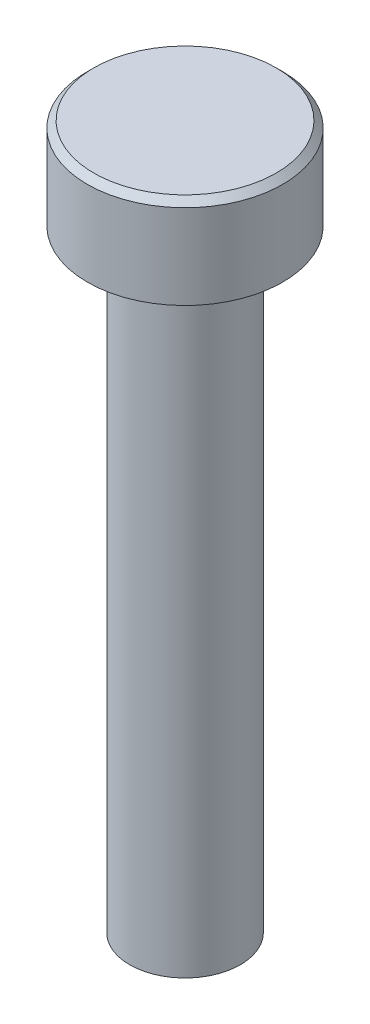
ISO-10303-21;
HEADER;
FILE_DESCRIPTION(('STEP AP214'),'2;1');
FILE_NAME('part.step','',(''),(''),'','','');
FILE_SCHEMA(('AUTOMOTIVE_DESIGN { 1 0 10303 214 1 1 1 1 }'));
ENDSEC;
DATA;
#1=APPLICATION_CONTEXT('core data for automotive mechanical design processes');
#2=APPLICATION_PROTOCOL_DEFINITION('international standard','automotive_design',2000,#1);
#3=PRODUCT_CONTEXT('',#1,'mechanical');
#4=PRODUCT('Part','Part','',(#3));
#5=PRODUCT_RELATED_PRODUCT_CATEGORY('part','',(#4));
#6=PRODUCT_DEFINITION_FORMATION('','',#4);
#7=PRODUCT_DEFINITION_CONTEXT('part definition',#1,'design');
#8=PRODUCT_DEFINITION('design','',#6,#7);
#9=PRODUCT_DEFINITION_SHAPE('','',#8);
#10=(LENGTH_UNIT() NAMED_UNIT(*) SI_UNIT(.MILLI.,.METRE.));
#11=(NAMED_UNIT(*) PLANE_ANGLE_UNIT() SI_UNIT($,.RADIAN.));
#12=(NAMED_UNIT(*) SI_UNIT($,.STERADIAN.) SOLID_ANGLE_UNIT());
#13=UNCERTAINTY_MEASURE_WITH_UNIT(LENGTH_MEASURE(1.E-05),#10,'distance_accuracy_value','');
#14=(GEOMETRIC_REPRESENTATION_CONTEXT(3) GLOBAL_UNCERTAINTY_ASSIGNED_CONTEXT((#13)) GLOBAL_UNIT_ASSIGNED_CONTEXT((#10,
#11,#12)) REPRESENTATION_CONTEXT('',''));
#15=CARTESIAN_POINT('',(0.,0.,0.));
#16=DIRECTION('',(0.,0.,1.));
#17=DIRECTION('',(1.,0.,0.));
#18=AXIS2_PLACEMENT_3D('',#15,#16,#17);
#19=CARTESIAN_POINT('',(8.5,0.,0.));
#20=DIRECTION('',(0.,1.,0.));
#21=DIRECTION('',(0.,0.,1.));
#22=AXIS2_PLACEMENT_3D('',#19,#20,#21);
#23=PLANE('',#22);
#24=CARTESIAN_POINT('',(0.,0.,0.));
#25=DIRECTION('',(0.,1.,0.));
#26=DIRECTION('',(0.,0.,1.));
#27=AXIS2_PLACEMENT_3D('',#24,#25,#26);
#28=CIRCLE('',#27,8.5);
#29=CARTESIAN_POINT('',(0.,0.,8.5));
#30=VERTEX_POINT('',#29);
#31=EDGE_CURVE('E63',#30,#30,#28,.T.);
#32=ORIENTED_EDGE('',*,*,#31,.F.);
#33=EDGE_LOOP('',(#32));
#34=FACE_BOUND('',#33,.T.);
#35=ADVANCED_FACE('F43',(#34),#23,.F.);
#36=CARTESIAN_POINT('',(0.,108.,0.));
#37=DIRECTION('',(0.,-1.,0.));
#38=DIRECTION('',(0.,0.,-1.));
#39=AXIS2_PLACEMENT_3D('',#36,#37,#38);
#40=PLANE('',#39);
#41=CARTESIAN_POINT('',(0.,108.,0.));
#42=DIRECTION('',(0.,-1.,0.));
#43=DIRECTION('',(0.,0.,-1.));
#44=AXIS2_PLACEMENT_3D('',#41,#42,#43);
#45=CIRCLE('',#44,14.);
#46=CARTESIAN_POINT('',(0.,108.,-14.));
#47=VERTEX_POINT('',#46);
#48=EDGE_CURVE('E50',#47,#47,#45,.F.);
#49=ORIENTED_EDGE('',*,*,#48,.T.);
#50=EDGE_LOOP('',(#49));
#51=FACE_BOUND('',#50,.T.);
#52=ADVANCED_FACE('F70',(#51),#40,.F.);
#53=CARTESIAN_POINT('',(0.,0.,0.));
#54=DIRECTION('',(0.,1.,0.));
#55=DIRECTION('',(0.,0.,1.));
#56=AXIS2_PLACEMENT_3D('',#53,#54,#55);
#57=CYLINDRICAL_SURFACE('',#56,15.);
#58=CARTESIAN_POINT('',(0.,107.,0.));
#59=DIRECTION('',(0.,-1.,0.));
#60=DIRECTION('',(0.,0.,-1.));
#61=AXIS2_PLACEMENT_3D('',#58,#59,#60);
#62=CIRCLE('',#61,15.);
#63=CARTESIAN_POINT('',(0.,107.,-15.));
#64=VERTEX_POINT('',#63);
#65=EDGE_CURVE('E10',#64,#64,#62,.T.);
#66=ORIENTED_EDGE('',*,*,#65,.T.);
#67=EDGE_LOOP('',(#66));
#68=FACE_BOUND('',#67,.T.);
#69=CARTESIAN_POINT('',(0.,94.,0.));
#70=DIRECTION('',(0.,1.,0.));
#71=DIRECTION('',(0.,0.,1.));
#72=AXIS2_PLACEMENT_3D('',#69,#70,#71);
#73=CIRCLE('',#72,15.);
#74=CARTESIAN_POINT('',(0.,94.,15.));
#75=VERTEX_POINT('',#74);
#76=EDGE_CURVE('E54',#75,#75,#73,.T.);
#77=ORIENTED_EDGE('',*,*,#76,.T.);
#78=EDGE_LOOP('',(#77));
#79=FACE_BOUND('',#78,.T.);
#80=ADVANCED_FACE('F75',(#68,#79),#57,.T.);
#81=CARTESIAN_POINT('',(15.,94.,0.));
#82=DIRECTION('',(0.,1.,0.));
#83=DIRECTION('',(0.,0.,1.));
#84=AXIS2_PLACEMENT_3D('',#81,#82,#83);
#85=PLANE('',#84);
#86=ORIENTED_EDGE('',*,*,#76,.F.);
#87=EDGE_LOOP('',(#86));
#88=FACE_BOUND('',#87,.T.);
#89=CARTESIAN_POINT('',(0.,94.,0.));
#90=DIRECTION('',(0.,1.,0.));
#91=DIRECTION('',(0.,0.,1.));
#92=AXIS2_PLACEMENT_3D('',#89,#90,#91);
#93=CIRCLE('',#92,8.49999999999999);
#94=CARTESIAN_POINT('',(0.,94.,8.49999999999999));
#95=VERTEX_POINT('',#94);
#96=EDGE_CURVE('E58',#95,#95,#93,.T.);
#97=ORIENTED_EDGE('',*,*,#96,.T.);
#98=EDGE_LOOP('',(#97));
#99=FACE_BOUND('',#98,.T.);
#100=ADVANCED_FACE('F80',(#88,#99),#85,.F.);
#101=CARTESIAN_POINT('',(0.,0.,0.));
#102=DIRECTION('',(0.,1.,0.));
#103=DIRECTION('',(0.,0.,1.));
#104=AXIS2_PLACEMENT_3D('',#101,#102,#103);
#105=CYLINDRICAL_SURFACE('',#104,8.5);
#106=ORIENTED_EDGE('',*,*,#96,.F.);
#107=EDGE_LOOP('',(#106));
#108=FACE_BOUND('',#107,.T.);
#109=ORIENTED_EDGE('',*,*,#31,.T.);
#110=EDGE_LOOP('',(#109));
#111=FACE_BOUND('',#110,.T.);
#112=ADVANCED_FACE('F67',(#108,#111),#105,.T.);
#113=CARTESIAN_POINT('',(0.,108.,0.));
#114=DIRECTION('',(0.,-1.,0.));
#115=DIRECTION('',(0.,0.,-1.));
#116=AXIS2_PLACEMENT_3D('',#113,#114,#115);
#117=CONICAL_SURFACE('',#116,14.,0.78539816339745);
#118=ORIENTED_EDGE('',*,*,#65,.F.);
#119=EDGE_LOOP('',(#118));
#120=FACE_BOUND('',#119,.T.);
#121=ORIENTED_EDGE('',*,*,#48,.F.);
#122=EDGE_LOOP('',(#121));
#123=FACE_BOUND('',#122,.T.);
#124=ADVANCED_FACE('F45',(#120,#123),#117,.T.);
#125=CLOSED_SHELL('',(#35,#52,#80,#100,#112,#124));
#126=MANIFOLD_SOLID_BREP('B2',#125);
#127=ADVANCED_BREP_SHAPE_REPRESENTATION('',(#18,#126),#14);
#128=SHAPE_DEFINITION_REPRESENTATION(#9,#127);
ENDSEC;
END-ISO-10303-21;
